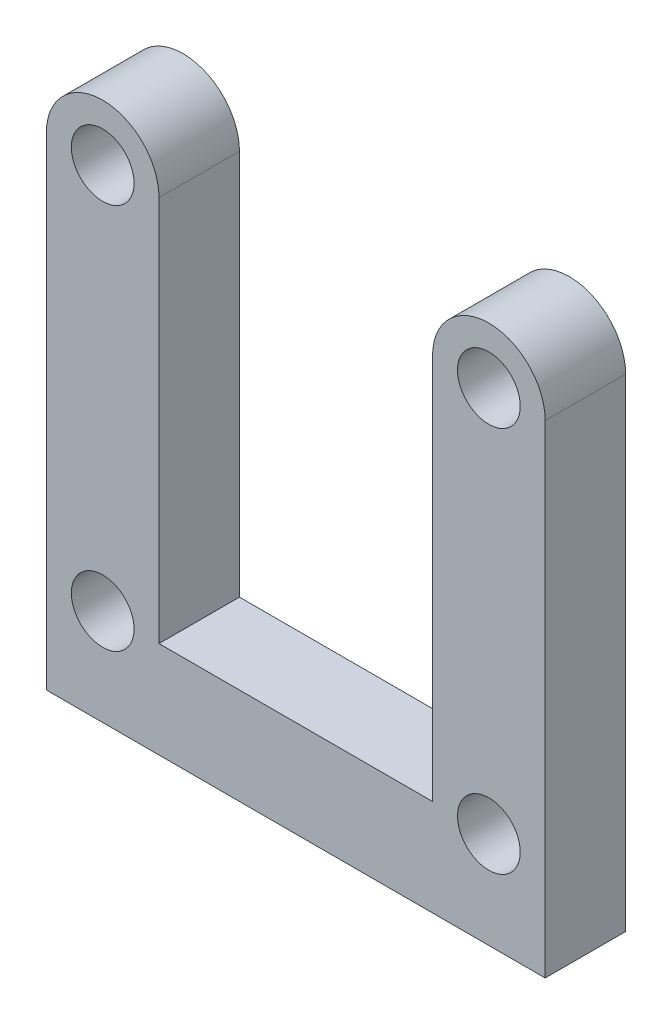
ISO-10303-21;
HEADER;
FILE_DESCRIPTION(('STEP AP214'),'2;1');
FILE_NAME('part.step','',(''),(''),'','','');
FILE_SCHEMA(('AUTOMOTIVE_DESIGN { 1 0 10303 214 1 1 1 1 }'));
ENDSEC;
DATA;
#1=APPLICATION_CONTEXT('core data for automotive mechanical design processes');
#2=APPLICATION_PROTOCOL_DEFINITION('international standard','automotive_design',2000,#1);
#3=PRODUCT_CONTEXT('',#1,'mechanical');
#4=PRODUCT('Part','Part','',(#3));
#5=PRODUCT_RELATED_PRODUCT_CATEGORY('part','',(#4));
#6=PRODUCT_DEFINITION_FORMATION('','',#4);
#7=PRODUCT_DEFINITION_CONTEXT('part definition',#1,'design');
#8=PRODUCT_DEFINITION('design','',#6,#7);
#9=PRODUCT_DEFINITION_SHAPE('','',#8);
#10=(LENGTH_UNIT() NAMED_UNIT(*) SI_UNIT(.MILLI.,.METRE.));
#11=(NAMED_UNIT(*) PLANE_ANGLE_UNIT() SI_UNIT($,.RADIAN.));
#12=(NAMED_UNIT(*) SI_UNIT($,.STERADIAN.) SOLID_ANGLE_UNIT());
#13=UNCERTAINTY_MEASURE_WITH_UNIT(LENGTH_MEASURE(1.E-05),#10,'distance_accuracy_value','');
#14=(GEOMETRIC_REPRESENTATION_CONTEXT(3) GLOBAL_UNCERTAINTY_ASSIGNED_CONTEXT((#13)) GLOBAL_UNIT_ASSIGNED_CONTEXT((#10,
#11,#12)) REPRESENTATION_CONTEXT('',''));
#15=CARTESIAN_POINT('',(0.,0.,0.));
#16=DIRECTION('',(0.,0.,1.));
#17=DIRECTION('',(1.,0.,0.));
#18=AXIS2_PLACEMENT_3D('',#15,#16,#17);
#19=CARTESIAN_POINT('',(15.5,0.,5.));
#20=DIRECTION('',(1.,0.,0.));
#21=DIRECTION('',(0.,1.,0.));
#22=AXIS2_PLACEMENT_3D('',#19,#20,#21);
#23=PLANE('',#22);
#24=DIRECTION('',(0.,-1.,0.));
#25=VECTOR('',#24,1.);
#26=CARTESIAN_POINT('',(15.5,0.,0.));
#27=LINE('',#26,#25);
#28=CARTESIAN_POINT('',(15.5,12.,0.));
#29=VERTEX_POINT('',#28);
#30=CARTESIAN_POINT('',(15.5,-18.,0.));
#31=VERTEX_POINT('',#30);
#32=EDGE_CURVE('E156',#29,#31,#27,.T.);
#33=ORIENTED_EDGE('',*,*,#32,.F.);
#34=DIRECTION('',(0.,0.,-1.));
#35=VECTOR('',#34,1.);
#36=CARTESIAN_POINT('',(15.5,12.,5.));
#37=LINE('',#36,#35);
#38=CARTESIAN_POINT('',(15.5,12.,5.));
#39=VERTEX_POINT('',#38);
#40=EDGE_CURVE('E11',#39,#29,#37,.T.);
#41=ORIENTED_EDGE('',*,*,#40,.F.);
#42=DIRECTION('',(0.,-1.,0.));
#43=VECTOR('',#42,1.);
#44=CARTESIAN_POINT('',(15.5,0.,5.));
#45=LINE('',#44,#43);
#46=CARTESIAN_POINT('',(15.5,-18.,5.));
#47=VERTEX_POINT('',#46);
#48=EDGE_CURVE('E273',#39,#47,#45,.T.);
#49=ORIENTED_EDGE('',*,*,#48,.T.);
#50=DIRECTION('',(0.,0.,-1.));
#51=VECTOR('',#50,1.);
#52=CARTESIAN_POINT('',(15.5,-18.,5.));
#53=LINE('',#52,#51);
#54=EDGE_CURVE('E58',#47,#31,#53,.T.);
#55=ORIENTED_EDGE('',*,*,#54,.T.);
#56=EDGE_LOOP('',(#33,#41,#49,#55));
#57=FACE_BOUND('',#56,.T.);
#58=ADVANCED_FACE('F41',(#57),#23,.T.);
#59=CARTESIAN_POINT('',(12.,12.,5.));
#60=DIRECTION('',(0.,0.,-1.));
#61=DIRECTION('',(-1.,0.,0.));
#62=AXIS2_PLACEMENT_3D('',#59,#60,#61);
#63=CYLINDRICAL_SURFACE('',#62,3.5);
#64=CARTESIAN_POINT('',(12.,12.,0.));
#65=DIRECTION('',(0.,0.,1.));
#66=DIRECTION('',(1.,0.,0.));
#67=AXIS2_PLACEMENT_3D('',#64,#65,#66);
#68=CIRCLE('',#67,3.5);
#69=CARTESIAN_POINT('',(8.5,12.,0.));
#70=VERTEX_POINT('',#69);
#71=EDGE_CURVE('E153',#29,#70,#68,.T.);
#72=ORIENTED_EDGE('',*,*,#71,.T.);
#73=DIRECTION('',(0.,0.,-1.));
#74=VECTOR('',#73,1.);
#75=CARTESIAN_POINT('',(8.5,12.,5.));
#76=LINE('',#75,#74);
#77=CARTESIAN_POINT('',(8.5,12.,5.));
#78=VERTEX_POINT('',#77);
#79=EDGE_CURVE('E50',#78,#70,#76,.T.);
#80=ORIENTED_EDGE('',*,*,#79,.F.);
#81=CARTESIAN_POINT('',(12.,12.,5.));
#82=DIRECTION('',(0.,0.,1.));
#83=DIRECTION('',(1.,0.,0.));
#84=AXIS2_PLACEMENT_3D('',#81,#82,#83);
#85=CIRCLE('',#84,3.5);
#86=EDGE_CURVE('E275',#39,#78,#85,.T.);
#87=ORIENTED_EDGE('',*,*,#86,.F.);
#88=ORIENTED_EDGE('',*,*,#40,.T.);
#89=EDGE_LOOP('',(#72,#80,#87,#88));
#90=FACE_BOUND('',#89,.T.);
#91=ADVANCED_FACE('F154',(#90),#63,.T.);
#92=CARTESIAN_POINT('',(8.5,0.,5.));
#93=DIRECTION('',(1.,0.,0.));
#94=DIRECTION('',(0.,1.,0.));
#95=AXIS2_PLACEMENT_3D('',#92,#93,#94);
#96=PLANE('',#95);
#97=DIRECTION('',(0.,-1.,0.));
#98=VECTOR('',#97,1.);
#99=CARTESIAN_POINT('',(8.5,0.,0.));
#100=LINE('',#99,#98);
#101=CARTESIAN_POINT('',(8.5,-12.,0.));
#102=VERTEX_POINT('',#101);
#103=EDGE_CURVE('E147',#70,#102,#100,.T.);
#104=ORIENTED_EDGE('',*,*,#103,.T.);
#105=DIRECTION('',(0.,0.,-1.));
#106=VECTOR('',#105,1.);
#107=CARTESIAN_POINT('',(8.5,-12.,5.));
#108=LINE('',#107,#106);
#109=CARTESIAN_POINT('',(8.5,-12.,5.));
#110=VERTEX_POINT('',#109);
#111=EDGE_CURVE('E139',#110,#102,#108,.T.);
#112=ORIENTED_EDGE('',*,*,#111,.F.);
#113=DIRECTION('',(0.,-1.,0.));
#114=VECTOR('',#113,1.);
#115=CARTESIAN_POINT('',(8.5,0.,5.));
#116=LINE('',#115,#114);
#117=EDGE_CURVE('E149',#78,#110,#116,.T.);
#118=ORIENTED_EDGE('',*,*,#117,.F.);
#119=ORIENTED_EDGE('',*,*,#79,.T.);
#120=EDGE_LOOP('',(#104,#112,#118,#119));
#121=FACE_BOUND('',#120,.T.);
#122=ADVANCED_FACE('F145',(#121),#96,.F.);
#123=CARTESIAN_POINT('',(0.,-12.,5.));
#124=DIRECTION('',(0.,1.,0.));
#125=DIRECTION('',(-1.,0.,0.));
#126=AXIS2_PLACEMENT_3D('',#123,#124,#125);
#127=PLANE('',#126);
#128=DIRECTION('',(1.,0.,0.));
#129=VECTOR('',#128,1.);
#130=CARTESIAN_POINT('',(0.,-12.,0.));
#131=LINE('',#130,#129);
#132=CARTESIAN_POINT('',(-8.5,-12.,0.));
#133=VERTEX_POINT('',#132);
#134=EDGE_CURVE('E158',#133,#102,#131,.T.);
#135=ORIENTED_EDGE('',*,*,#134,.F.);
#136=DIRECTION('',(0.,0.,-1.));
#137=VECTOR('',#136,1.);
#138=CARTESIAN_POINT('',(-8.5,-12.,5.));
#139=LINE('',#138,#137);
#140=CARTESIAN_POINT('',(-8.5,-12.,5.));
#141=VERTEX_POINT('',#140);
#142=EDGE_CURVE('E133',#141,#133,#139,.T.);
#143=ORIENTED_EDGE('',*,*,#142,.F.);
#144=DIRECTION('',(1.,0.,0.));
#145=VECTOR('',#144,1.);
#146=CARTESIAN_POINT('',(0.,-12.,5.));
#147=LINE('',#146,#145);
#148=EDGE_CURVE('E278',#141,#110,#147,.T.);
#149=ORIENTED_EDGE('',*,*,#148,.T.);
#150=ORIENTED_EDGE('',*,*,#111,.T.);
#151=EDGE_LOOP('',(#135,#143,#149,#150));
#152=FACE_BOUND('',#151,.T.);
#153=ADVANCED_FACE('F213',(#152),#127,.T.);
#154=CARTESIAN_POINT('',(-8.5,0.,5.));
#155=DIRECTION('',(1.,0.,0.));
#156=DIRECTION('',(0.,1.,0.));
#157=AXIS2_PLACEMENT_3D('',#154,#155,#156);
#158=PLANE('',#157);
#159=DIRECTION('',(0.,-1.,0.));
#160=VECTOR('',#159,1.);
#161=CARTESIAN_POINT('',(-8.5,0.,0.));
#162=LINE('',#161,#160);
#163=CARTESIAN_POINT('',(-8.5,12.,0.));
#164=VERTEX_POINT('',#163);
#165=EDGE_CURVE('E165',#164,#133,#162,.T.);
#166=ORIENTED_EDGE('',*,*,#165,.F.);
#167=DIRECTION('',(0.,0.,-1.));
#168=VECTOR('',#167,1.);
#169=CARTESIAN_POINT('',(-8.5,12.,5.));
#170=LINE('',#169,#168);
#171=CARTESIAN_POINT('',(-8.5,12.,5.));
#172=VERTEX_POINT('',#171);
#173=EDGE_CURVE('E131',#172,#164,#170,.T.);
#174=ORIENTED_EDGE('',*,*,#173,.F.);
#175=DIRECTION('',(0.,-1.,0.));
#176=VECTOR('',#175,1.);
#177=CARTESIAN_POINT('',(-8.5,0.,5.));
#178=LINE('',#177,#176);
#179=EDGE_CURVE('E125',#172,#141,#178,.T.);
#180=ORIENTED_EDGE('',*,*,#179,.T.);
#181=ORIENTED_EDGE('',*,*,#142,.T.);
#182=EDGE_LOOP('',(#166,#174,#180,#181));
#183=FACE_BOUND('',#182,.T.);
#184=ADVANCED_FACE('F216',(#183),#158,.T.);
#185=CARTESIAN_POINT('',(-12.,12.,5.));
#186=DIRECTION('',(0.,0.,-1.));
#187=DIRECTION('',(-1.,0.,0.));
#188=AXIS2_PLACEMENT_3D('',#185,#186,#187);
#189=CYLINDRICAL_SURFACE('',#188,3.5);
#190=CARTESIAN_POINT('',(-12.,12.,0.));
#191=DIRECTION('',(0.,0.,1.));
#192=DIRECTION('',(1.,0.,0.));
#193=AXIS2_PLACEMENT_3D('',#190,#191,#192);
#194=CIRCLE('',#193,3.5);
#195=CARTESIAN_POINT('',(-15.5,12.,0.));
#196=VERTEX_POINT('',#195);
#197=EDGE_CURVE('E130',#164,#196,#194,.T.);
#198=ORIENTED_EDGE('',*,*,#197,.T.);
#199=DIRECTION('',(0.,0.,-1.));
#200=VECTOR('',#199,1.);
#201=CARTESIAN_POINT('',(-15.5,12.,5.));
#202=LINE('',#201,#200);
#203=CARTESIAN_POINT('',(-15.5,12.,5.));
#204=VERTEX_POINT('',#203);
#205=EDGE_CURVE('E112',#204,#196,#202,.T.);
#206=ORIENTED_EDGE('',*,*,#205,.F.);
#207=CARTESIAN_POINT('',(-12.,12.,5.));
#208=DIRECTION('',(0.,0.,1.));
#209=DIRECTION('',(1.,0.,0.));
#210=AXIS2_PLACEMENT_3D('',#207,#208,#209);
#211=CIRCLE('',#210,3.5);
#212=EDGE_CURVE('E117',#172,#204,#211,.T.);
#213=ORIENTED_EDGE('',*,*,#212,.F.);
#214=ORIENTED_EDGE('',*,*,#173,.T.);
#215=EDGE_LOOP('',(#198,#206,#213,#214));
#216=FACE_BOUND('',#215,.T.);
#217=ADVANCED_FACE('F128',(#216),#189,.T.);
#218=CARTESIAN_POINT('',(-15.5,0.,5.));
#219=DIRECTION('',(1.,0.,0.));
#220=DIRECTION('',(0.,1.,0.));
#221=AXIS2_PLACEMENT_3D('',#218,#219,#220);
#222=PLANE('',#221);
#223=DIRECTION('',(0.,-1.,0.));
#224=VECTOR('',#223,1.);
#225=CARTESIAN_POINT('',(-15.5,0.,0.));
#226=LINE('',#225,#224);
#227=CARTESIAN_POINT('',(-15.5,-18.,0.));
#228=VERTEX_POINT('',#227);
#229=EDGE_CURVE('E169',#196,#228,#226,.T.);
#230=ORIENTED_EDGE('',*,*,#229,.T.);
#231=DIRECTION('',(0.,0.,-1.));
#232=VECTOR('',#231,1.);
#233=CARTESIAN_POINT('',(-15.5,-18.,5.));
#234=LINE('',#233,#232);
#235=CARTESIAN_POINT('',(-15.5,-18.,5.));
#236=VERTEX_POINT('',#235);
#237=EDGE_CURVE('E84',#236,#228,#234,.T.);
#238=ORIENTED_EDGE('',*,*,#237,.F.);
#239=DIRECTION('',(0.,-1.,0.));
#240=VECTOR('',#239,1.);
#241=CARTESIAN_POINT('',(-15.5,0.,5.));
#242=LINE('',#241,#240);
#243=EDGE_CURVE('E108',#204,#236,#242,.T.);
#244=ORIENTED_EDGE('',*,*,#243,.F.);
#245=ORIENTED_EDGE('',*,*,#205,.T.);
#246=EDGE_LOOP('',(#230,#238,#244,#245));
#247=FACE_BOUND('',#246,.T.);
#248=ADVANCED_FACE('F110',(#247),#222,.F.);
#249=CARTESIAN_POINT('',(12.,-12.,5.));
#250=DIRECTION('',(0.,0.,-1.));
#251=DIRECTION('',(-1.,0.,0.));
#252=AXIS2_PLACEMENT_3D('',#249,#250,#251);
#253=CYLINDRICAL_SURFACE('',#252,1.95);
#254=CARTESIAN_POINT('',(12.,-12.,5.));
#255=DIRECTION('',(0.,0.,1.));
#256=DIRECTION('',(1.,0.,0.));
#257=AXIS2_PLACEMENT_3D('',#254,#255,#256);
#258=CIRCLE('',#257,1.95);
#259=CARTESIAN_POINT('',(13.95,-12.,5.));
#260=VERTEX_POINT('',#259);
#261=EDGE_CURVE('E271',#260,#260,#258,.T.);
#262=ORIENTED_EDGE('',*,*,#261,.T.);
#263=EDGE_LOOP('',(#262));
#264=FACE_BOUND('',#263,.T.);
#265=CARTESIAN_POINT('',(12.,-12.,0.));
#266=DIRECTION('',(0.,0.,1.));
#267=DIRECTION('',(1.,0.,0.));
#268=AXIS2_PLACEMENT_3D('',#265,#266,#267);
#269=CIRCLE('',#268,1.95);
#270=CARTESIAN_POINT('',(13.95,-12.,0.));
#271=VERTEX_POINT('',#270);
#272=EDGE_CURVE('E160',#271,#271,#269,.T.);
#273=ORIENTED_EDGE('',*,*,#272,.F.);
#274=EDGE_LOOP('',(#273));
#275=FACE_BOUND('',#274,.T.);
#276=ADVANCED_FACE('F190',(#264,#275),#253,.F.);
#277=CARTESIAN_POINT('',(12.,12.,5.));
#278=DIRECTION('',(0.,0.,-1.));
#279=DIRECTION('',(-1.,0.,0.));
#280=AXIS2_PLACEMENT_3D('',#277,#278,#279);
#281=CYLINDRICAL_SURFACE('',#280,1.95);
#282=CARTESIAN_POINT('',(12.,12.,5.));
#283=DIRECTION('',(0.,0.,1.));
#284=DIRECTION('',(1.,0.,0.));
#285=AXIS2_PLACEMENT_3D('',#282,#283,#284);
#286=CIRCLE('',#285,1.95);
#287=CARTESIAN_POINT('',(13.95,12.,5.));
#288=VERTEX_POINT('',#287);
#289=EDGE_CURVE('E268',#288,#288,#286,.T.);
#290=ORIENTED_EDGE('',*,*,#289,.T.);
#291=EDGE_LOOP('',(#290));
#292=FACE_BOUND('',#291,.T.);
#293=CARTESIAN_POINT('',(12.,12.,0.));
#294=DIRECTION('',(0.,0.,1.));
#295=DIRECTION('',(1.,0.,0.));
#296=AXIS2_PLACEMENT_3D('',#293,#294,#295);
#297=CIRCLE('',#296,1.95);
#298=CARTESIAN_POINT('',(13.95,12.,0.));
#299=VERTEX_POINT('',#298);
#300=EDGE_CURVE('E183',#299,#299,#297,.T.);
#301=ORIENTED_EDGE('',*,*,#300,.F.);
#302=EDGE_LOOP('',(#301));
#303=FACE_BOUND('',#302,.T.);
#304=ADVANCED_FACE('F192',(#292,#303),#281,.F.);
#305=CARTESIAN_POINT('',(-12.,12.,5.));
#306=DIRECTION('',(0.,0.,-1.));
#307=DIRECTION('',(-1.,0.,0.));
#308=AXIS2_PLACEMENT_3D('',#305,#306,#307);
#309=CYLINDRICAL_SURFACE('',#308,1.95);
#310=CARTESIAN_POINT('',(-12.,12.,5.));
#311=DIRECTION('',(0.,0.,1.));
#312=DIRECTION('',(1.,0.,0.));
#313=AXIS2_PLACEMENT_3D('',#310,#311,#312);
#314=CIRCLE('',#313,1.95);
#315=CARTESIAN_POINT('',(-10.05,12.,5.));
#316=VERTEX_POINT('',#315);
#317=EDGE_CURVE('E265',#316,#316,#314,.T.);
#318=ORIENTED_EDGE('',*,*,#317,.T.);
#319=EDGE_LOOP('',(#318));
#320=FACE_BOUND('',#319,.T.);
#321=CARTESIAN_POINT('',(-12.,12.,0.));
#322=DIRECTION('',(0.,0.,1.));
#323=DIRECTION('',(1.,0.,0.));
#324=AXIS2_PLACEMENT_3D('',#321,#322,#323);
#325=CIRCLE('',#324,1.95);
#326=CARTESIAN_POINT('',(-10.05,12.,0.));
#327=VERTEX_POINT('',#326);
#328=EDGE_CURVE('E179',#327,#327,#325,.T.);
#329=ORIENTED_EDGE('',*,*,#328,.F.);
#330=EDGE_LOOP('',(#329));
#331=FACE_BOUND('',#330,.T.);
#332=ADVANCED_FACE('F199',(#320,#331),#309,.F.);
#333=CARTESIAN_POINT('',(-12.,-12.,5.));
#334=DIRECTION('',(0.,0.,-1.));
#335=DIRECTION('',(-1.,0.,0.));
#336=AXIS2_PLACEMENT_3D('',#333,#334,#335);
#337=CYLINDRICAL_SURFACE('',#336,1.95);
#338=CARTESIAN_POINT('',(-12.,-12.,5.));
#339=DIRECTION('',(0.,0.,1.));
#340=DIRECTION('',(1.,0.,0.));
#341=AXIS2_PLACEMENT_3D('',#338,#339,#340);
#342=CIRCLE('',#341,1.95);
#343=CARTESIAN_POINT('',(-10.05,-12.,5.));
#344=VERTEX_POINT('',#343);
#345=EDGE_CURVE('E173',#344,#344,#342,.T.);
#346=ORIENTED_EDGE('',*,*,#345,.T.);
#347=EDGE_LOOP('',(#346));
#348=FACE_BOUND('',#347,.T.);
#349=CARTESIAN_POINT('',(-12.,-12.,0.));
#350=DIRECTION('',(0.,0.,1.));
#351=DIRECTION('',(1.,0.,0.));
#352=AXIS2_PLACEMENT_3D('',#349,#350,#351);
#353=CIRCLE('',#352,1.95);
#354=CARTESIAN_POINT('',(-10.05,-12.,0.));
#355=VERTEX_POINT('',#354);
#356=EDGE_CURVE('E176',#355,#355,#353,.T.);
#357=ORIENTED_EDGE('',*,*,#356,.F.);
#358=EDGE_LOOP('',(#357));
#359=FACE_BOUND('',#358,.T.);
#360=ADVANCED_FACE('F43',(#348,#359),#337,.F.);
#361=CARTESIAN_POINT('',(0.,-18.,5.));
#362=DIRECTION('',(0.,-1.,0.));
#363=DIRECTION('',(0.,0.,-1.));
#364=AXIS2_PLACEMENT_3D('',#361,#362,#363);
#365=PLANE('',#364);
#366=CARTESIAN_POINT('',(-8.,-18.,2.5));
#367=DIRECTION('',(0.,-1.,0.));
#368=DIRECTION('',(0.,0.,-1.));
#369=AXIS2_PLACEMENT_3D('',#366,#367,#368);
#370=CIRCLE('',#369,1.25);
#371=CARTESIAN_POINT('',(-8.,-18.,1.25));
#372=VERTEX_POINT('',#371);
#373=EDGE_CURVE('E252',#372,#372,#370,.T.);
#374=ORIENTED_EDGE('',*,*,#373,.F.);
#375=EDGE_LOOP('',(#374));
#376=FACE_BOUND('',#375,.T.);
#377=CARTESIAN_POINT('',(8.,-18.,2.5));
#378=DIRECTION('',(0.,-1.,0.));
#379=DIRECTION('',(0.,0.,-1.));
#380=AXIS2_PLACEMENT_3D('',#377,#378,#379);
#381=CIRCLE('',#380,1.25);
#382=CARTESIAN_POINT('',(8.,-18.,1.25));
#383=VERTEX_POINT('',#382);
#384=EDGE_CURVE('E255',#383,#383,#381,.T.);
#385=ORIENTED_EDGE('',*,*,#384,.F.);
#386=EDGE_LOOP('',(#385));
#387=FACE_BOUND('',#386,.T.);
#388=DIRECTION('',(-1.,0.,0.));
#389=VECTOR('',#388,1.);
#390=CARTESIAN_POINT('',(0.,-18.,0.));
#391=LINE('',#390,#389);
#392=EDGE_CURVE('E171',#31,#228,#391,.T.);
#393=ORIENTED_EDGE('',*,*,#392,.F.);
#394=ORIENTED_EDGE('',*,*,#54,.F.);
#395=DIRECTION('',(-1.,0.,0.));
#396=VECTOR('',#395,1.);
#397=CARTESIAN_POINT('',(0.,-18.,5.));
#398=LINE('',#397,#396);
#399=EDGE_CURVE('E116',#47,#236,#398,.T.);
#400=ORIENTED_EDGE('',*,*,#399,.T.);
#401=ORIENTED_EDGE('',*,*,#237,.T.);
#402=EDGE_LOOP('',(#393,#394,#400,#401));
#403=FACE_BOUND('',#402,.T.);
#404=ADVANCED_FACE('F223',(#376,#387,#403),#365,.T.);
#405=CARTESIAN_POINT('',(0.,0.,5.));
#406=DIRECTION('',(0.,0.,1.));
#407=DIRECTION('',(1.,0.,0.));
#408=AXIS2_PLACEMENT_3D('',#405,#406,#407);
#409=PLANE('',#408);
#410=ORIENTED_EDGE('',*,*,#345,.F.);
#411=EDGE_LOOP('',(#410));
#412=FACE_BOUND('',#411,.T.);
#413=ORIENTED_EDGE('',*,*,#317,.F.);
#414=EDGE_LOOP('',(#413));
#415=FACE_BOUND('',#414,.T.);
#416=ORIENTED_EDGE('',*,*,#289,.F.);
#417=EDGE_LOOP('',(#416));
#418=FACE_BOUND('',#417,.T.);
#419=ORIENTED_EDGE('',*,*,#261,.F.);
#420=EDGE_LOOP('',(#419));
#421=FACE_BOUND('',#420,.T.);
#422=ORIENTED_EDGE('',*,*,#48,.F.);
#423=ORIENTED_EDGE('',*,*,#86,.T.);
#424=ORIENTED_EDGE('',*,*,#117,.T.);
#425=ORIENTED_EDGE('',*,*,#148,.F.);
#426=ORIENTED_EDGE('',*,*,#179,.F.);
#427=ORIENTED_EDGE('',*,*,#212,.T.);
#428=ORIENTED_EDGE('',*,*,#243,.T.);
#429=ORIENTED_EDGE('',*,*,#399,.F.);
#430=EDGE_LOOP('',(#422,#423,#424,#425,#426,#427,#428,#429));
#431=FACE_BOUND('',#430,.T.);
#432=ADVANCED_FACE('F122',(#412,#415,#418,#421,#431),#409,.T.);
#433=CARTESIAN_POINT('',(0.,0.,0.));
#434=DIRECTION('',(0.,0.,1.));
#435=DIRECTION('',(1.,0.,0.));
#436=AXIS2_PLACEMENT_3D('',#433,#434,#435);
#437=PLANE('',#436);
#438=ORIENTED_EDGE('',*,*,#356,.T.);
#439=EDGE_LOOP('',(#438));
#440=FACE_BOUND('',#439,.T.);
#441=ORIENTED_EDGE('',*,*,#328,.T.);
#442=EDGE_LOOP('',(#441));
#443=FACE_BOUND('',#442,.T.);
#444=ORIENTED_EDGE('',*,*,#300,.T.);
#445=EDGE_LOOP('',(#444));
#446=FACE_BOUND('',#445,.T.);
#447=ORIENTED_EDGE('',*,*,#272,.T.);
#448=EDGE_LOOP('',(#447));
#449=FACE_BOUND('',#448,.T.);
#450=ORIENTED_EDGE('',*,*,#32,.T.);
#451=ORIENTED_EDGE('',*,*,#392,.T.);
#452=ORIENTED_EDGE('',*,*,#229,.F.);
#453=ORIENTED_EDGE('',*,*,#197,.F.);
#454=ORIENTED_EDGE('',*,*,#165,.T.);
#455=ORIENTED_EDGE('',*,*,#134,.T.);
#456=ORIENTED_EDGE('',*,*,#103,.F.);
#457=ORIENTED_EDGE('',*,*,#71,.F.);
#458=EDGE_LOOP('',(#450,#451,#452,#453,#454,#455,#456,#457));
#459=FACE_BOUND('',#458,.T.);
#460=ADVANCED_FACE('F188',(#440,#443,#446,#449,#459),#437,.F.);
#461=CARTESIAN_POINT('',(8.,-12.5,2.5));
#462=DIRECTION('',(0.,-1.,0.));
#463=DIRECTION('',(0.,0.,-1.));
#464=AXIS2_PLACEMENT_3D('',#461,#462,#463);
#465=CYLINDRICAL_SURFACE('',#464,1.25);
#466=CARTESIAN_POINT('',(8.,-12.5,2.5));
#467=DIRECTION('',(0.,-1.,0.));
#468=DIRECTION('',(0.,0.,-1.));
#469=AXIS2_PLACEMENT_3D('',#466,#467,#468);
#470=CIRCLE('',#469,1.25);
#471=CARTESIAN_POINT('',(8.,-12.5,1.25));
#472=VERTEX_POINT('',#471);
#473=EDGE_CURVE('E260',#472,#472,#470,.T.);
#474=ORIENTED_EDGE('',*,*,#473,.F.);
#475=EDGE_LOOP('',(#474));
#476=FACE_BOUND('',#475,.T.);
#477=ORIENTED_EDGE('',*,*,#384,.T.);
#478=EDGE_LOOP('',(#477));
#479=FACE_BOUND('',#478,.T.);
#480=ADVANCED_FACE('F229',(#476,#479),#465,.F.);
#481=CARTESIAN_POINT('',(8.,-12.5,2.5));
#482=DIRECTION('',(0.,-1.,0.));
#483=DIRECTION('',(0.,0.,-1.));
#484=AXIS2_PLACEMENT_3D('',#481,#482,#483);
#485=PLANE('',#484);
#486=ORIENTED_EDGE('',*,*,#473,.T.);
#487=EDGE_LOOP('',(#486));
#488=FACE_BOUND('',#487,.T.);
#489=ADVANCED_FACE('F234',(#488),#485,.T.);
#490=CARTESIAN_POINT('',(-8.,-12.5,2.5));
#491=DIRECTION('',(0.,-1.,0.));
#492=DIRECTION('',(0.,0.,-1.));
#493=AXIS2_PLACEMENT_3D('',#490,#491,#492);
#494=CYLINDRICAL_SURFACE('',#493,1.25);
#495=CARTESIAN_POINT('',(-8.,-12.5,2.5));
#496=DIRECTION('',(0.,-1.,0.));
#497=DIRECTION('',(0.,0.,-1.));
#498=AXIS2_PLACEMENT_3D('',#495,#496,#497);
#499=CIRCLE('',#498,1.25);
#500=CARTESIAN_POINT('',(-8.,-12.5,1.25));
#501=VERTEX_POINT('',#500);
#502=EDGE_CURVE('E180',#501,#501,#499,.T.);
#503=ORIENTED_EDGE('',*,*,#502,.F.);
#504=EDGE_LOOP('',(#503));
#505=FACE_BOUND('',#504,.T.);
#506=ORIENTED_EDGE('',*,*,#373,.T.);
#507=EDGE_LOOP('',(#506));
#508=FACE_BOUND('',#507,.T.);
#509=ADVANCED_FACE('F237',(#505,#508),#494,.F.);
#510=CARTESIAN_POINT('',(-8.,-12.5,2.5));
#511=DIRECTION('',(0.,-1.,0.));
#512=DIRECTION('',(0.,0.,-1.));
#513=AXIS2_PLACEMENT_3D('',#510,#511,#512);
#514=PLANE('',#513);
#515=ORIENTED_EDGE('',*,*,#502,.T.);
#516=EDGE_LOOP('',(#515));
#517=FACE_BOUND('',#516,.T.);
#518=ADVANCED_FACE('F244',(#517),#514,.T.);
#519=CLOSED_SHELL('',(#58,#91,#122,#153,#184,#217,#248,#276,#304,#332,#360,#404,#432,#460,#480,
#489,#509,#518));
#520=MANIFOLD_SOLID_BREP('B2',#519);
#521=ADVANCED_BREP_SHAPE_REPRESENTATION('',(#18,#520),#14);
#522=SHAPE_DEFINITION_REPRESENTATION(#9,#521);
ENDSEC;
END-ISO-10303-21;
